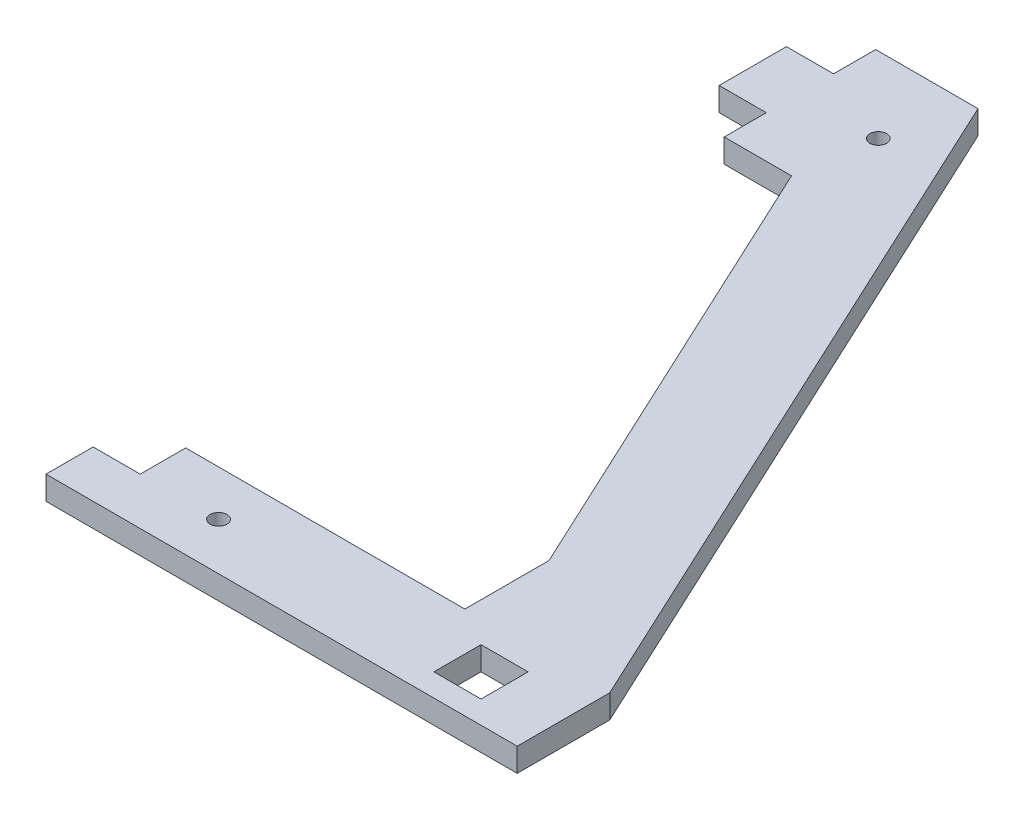
ISO-10303-21;
HEADER;
FILE_DESCRIPTION(('STEP AP214'),'2;1');
FILE_NAME('part.step','',(''),(''),'','','');
FILE_SCHEMA(('AUTOMOTIVE_DESIGN { 1 0 10303 214 1 1 1 1 }'));
ENDSEC;
DATA;
#1=APPLICATION_CONTEXT('core data for automotive mechanical design processes');
#2=APPLICATION_PROTOCOL_DEFINITION('international standard','automotive_design',2000,#1);
#3=PRODUCT_CONTEXT('',#1,'mechanical');
#4=PRODUCT('Part','Part','',(#3));
#5=PRODUCT_RELATED_PRODUCT_CATEGORY('part','',(#4));
#6=PRODUCT_DEFINITION_FORMATION('','',#4);
#7=PRODUCT_DEFINITION_CONTEXT('part definition',#1,'design');
#8=PRODUCT_DEFINITION('design','',#6,#7);
#9=PRODUCT_DEFINITION_SHAPE('','',#8);
#10=(LENGTH_UNIT() NAMED_UNIT(*) SI_UNIT(.MILLI.,.METRE.));
#11=(NAMED_UNIT(*) PLANE_ANGLE_UNIT() SI_UNIT($,.RADIAN.));
#12=(NAMED_UNIT(*) SI_UNIT($,.STERADIAN.) SOLID_ANGLE_UNIT());
#13=UNCERTAINTY_MEASURE_WITH_UNIT(LENGTH_MEASURE(1.E-05),#10,'distance_accuracy_value','');
#14=(GEOMETRIC_REPRESENTATION_CONTEXT(3) GLOBAL_UNCERTAINTY_ASSIGNED_CONTEXT((#13)) GLOBAL_UNIT_ASSIGNED_CONTEXT((#10,
#11,#12)) REPRESENTATION_CONTEXT('',''));
#15=CARTESIAN_POINT('',(0.,0.,0.));
#16=DIRECTION('',(0.,0.,1.));
#17=DIRECTION('',(1.,0.,0.));
#18=AXIS2_PLACEMENT_3D('',#15,#16,#17);
#19=CARTESIAN_POINT('',(0.,7.,0.));
#20=DIRECTION('',(0.,1.,0.));
#21=DIRECTION('',(0.,0.,1.));
#22=AXIS2_PLACEMENT_3D('',#19,#20,#21);
#23=PLANE('',#22);
#24=CARTESIAN_POINT('',(-102.73,7.,-14.));
#25=DIRECTION('',(0.,1.,0.));
#26=DIRECTION('',(0.,0.,1.));
#27=AXIS2_PLACEMENT_3D('',#24,#25,#26);
#28=CIRCLE('',#27,2.49999999999999);
#29=CARTESIAN_POINT('',(-102.73,7.,-11.5));
#30=VERTEX_POINT('',#29);
#31=EDGE_CURVE('E205',#30,#30,#28,.T.);
#32=ORIENTED_EDGE('',*,*,#31,.F.);
#33=EDGE_LOOP('',(#32));
#34=FACE_BOUND('',#33,.T.);
#35=DIRECTION('',(-1.,0.,0.));
#36=VECTOR('',#35,1.);
#37=CARTESIAN_POINT('',(-126.,7.,-232.5));
#38=LINE('',#37,#36);
#39=CARTESIAN_POINT('',(-95.5930699217742,7.,-232.5));
#40=VERTEX_POINT('',#39);
#41=CARTESIAN_POINT('',(-126.,7.,-232.5));
#42=VERTEX_POINT('',#41);
#43=EDGE_CURVE('E215',#40,#42,#38,.T.);
#44=ORIENTED_EDGE('',*,*,#43,.T.);
#45=DIRECTION('',(0.,0.,1.));
#46=VECTOR('',#45,1.);
#47=CARTESIAN_POINT('',(-126.,7.,-220.));
#48=LINE('',#47,#46);
#49=CARTESIAN_POINT('',(-126.,7.,-220.));
#50=VERTEX_POINT('',#49);
#51=EDGE_CURVE('E218',#42,#50,#48,.T.);
#52=ORIENTED_EDGE('',*,*,#51,.T.);
#53=DIRECTION('',(-1.,0.,0.));
#54=VECTOR('',#53,1.);
#55=CARTESIAN_POINT('',(-140.,7.,-220.));
#56=LINE('',#55,#54);
#57=CARTESIAN_POINT('',(-140.,7.,-220.));
#58=VERTEX_POINT('',#57);
#59=EDGE_CURVE('E221',#50,#58,#56,.T.);
#60=ORIENTED_EDGE('',*,*,#59,.T.);
#61=DIRECTION('',(0.,0.,1.));
#62=VECTOR('',#61,1.);
#63=CARTESIAN_POINT('',(-140.,7.,-200.));
#64=LINE('',#63,#62);
#65=CARTESIAN_POINT('',(-140.,7.,-200.));
#66=VERTEX_POINT('',#65);
#67=EDGE_CURVE('E223',#58,#66,#64,.T.);
#68=ORIENTED_EDGE('',*,*,#67,.T.);
#69=DIRECTION('',(1.,0.,0.));
#70=VECTOR('',#69,1.);
#71=CARTESIAN_POINT('',(-126.,7.,-200.));
#72=LINE('',#71,#70);
#73=CARTESIAN_POINT('',(-126.,7.,-200.));
#74=VERTEX_POINT('',#73);
#75=EDGE_CURVE('E225',#66,#74,#72,.T.);
#76=ORIENTED_EDGE('',*,*,#75,.T.);
#77=DIRECTION('',(0.,0.,1.));
#78=VECTOR('',#77,1.);
#79=CARTESIAN_POINT('',(-126.,7.,-187.5));
#80=LINE('',#79,#78);
#81=CARTESIAN_POINT('',(-126.,7.,-187.5));
#82=VERTEX_POINT('',#81);
#83=EDGE_CURVE('E227',#74,#82,#80,.T.);
#84=ORIENTED_EDGE('',*,*,#83,.T.);
#85=DIRECTION('',(1.,0.,0.));
#86=VECTOR('',#85,1.);
#87=CARTESIAN_POINT('',(-126.,7.,-187.5));
#88=LINE('',#87,#86);
#89=CARTESIAN_POINT('',(-106.,7.,-187.5));
#90=VERTEX_POINT('',#89);
#91=EDGE_CURVE('E229',#82,#90,#88,.T.);
#92=ORIENTED_EDGE('',*,*,#91,.T.);
#93=DIRECTION('',(0.422618261740697,0.,0.906307787036651));
#94=VECTOR('',#93,1.);
#95=CARTESIAN_POINT('',(-106.,7.,-187.5));
#96=LINE('',#95,#94);
#97=CARTESIAN_POINT('',(-43.0484661490756,7.,-52.5));
#98=VERTEX_POINT('',#97);
#99=EDGE_CURVE('E231',#90,#98,#96,.T.);
#100=ORIENTED_EDGE('',*,*,#99,.T.);
#101=DIRECTION('',(0.,0.,1.));
#102=VECTOR('',#101,1.);
#103=CARTESIAN_POINT('',(-43.0484661490756,7.,-52.5));
#104=LINE('',#103,#102);
#105=CARTESIAN_POINT('',(-43.0484661490756,7.,-27.5));
#106=VERTEX_POINT('',#105);
#107=EDGE_CURVE('E233',#98,#106,#104,.T.);
#108=ORIENTED_EDGE('',*,*,#107,.T.);
#109=DIRECTION('',(-1.,0.,0.));
#110=VECTOR('',#109,1.);
#111=CARTESIAN_POINT('',(-126.,7.,-27.5));
#112=LINE('',#111,#110);
#113=CARTESIAN_POINT('',(-126.,7.,-27.5));
#114=VERTEX_POINT('',#113);
#115=EDGE_CURVE('E235',#106,#114,#112,.T.);
#116=ORIENTED_EDGE('',*,*,#115,.T.);
#117=DIRECTION('',(0.,0.,1.));
#118=VECTOR('',#117,1.);
#119=CARTESIAN_POINT('',(-126.,7.,-14.));
#120=LINE('',#119,#118);
#121=CARTESIAN_POINT('',(-126.,7.,-14.));
#122=VERTEX_POINT('',#121);
#123=EDGE_CURVE('E237',#114,#122,#120,.T.);
#124=ORIENTED_EDGE('',*,*,#123,.T.);
#125=DIRECTION('',(-1.,0.,0.));
#126=VECTOR('',#125,1.);
#127=CARTESIAN_POINT('',(-140.,7.,-14.));
#128=LINE('',#127,#126);
#129=CARTESIAN_POINT('',(-140.,7.,-14.));
#130=VERTEX_POINT('',#129);
#131=EDGE_CURVE('E239',#122,#130,#128,.T.);
#132=ORIENTED_EDGE('',*,*,#131,.T.);
#133=DIRECTION('',(0.,0.,1.));
#134=VECTOR('',#133,1.);
#135=CARTESIAN_POINT('',(-140.,7.,0.));
#136=LINE('',#135,#134);
#137=CARTESIAN_POINT('',(-140.,7.,0.));
#138=VERTEX_POINT('',#137);
#139=EDGE_CURVE('E241',#130,#138,#136,.T.);
#140=ORIENTED_EDGE('',*,*,#139,.T.);
#141=DIRECTION('',(1.,0.,0.));
#142=VECTOR('',#141,1.);
#143=CARTESIAN_POINT('',(-140.,7.,0.));
#144=LINE('',#143,#142);
#145=CARTESIAN_POINT('',(0.,7.,0.));
#146=VERTEX_POINT('',#145);
#147=EDGE_CURVE('E243',#138,#146,#144,.T.);
#148=ORIENTED_EDGE('',*,*,#147,.T.);
#149=DIRECTION('',(0.,0.,-1.));
#150=VECTOR('',#149,1.);
#151=CARTESIAN_POINT('',(0.,7.,0.));
#152=LINE('',#151,#150);
#153=CARTESIAN_POINT('',(0.,7.,-27.5));
#154=VERTEX_POINT('',#153);
#155=EDGE_CURVE('E245',#146,#154,#152,.T.);
#156=ORIENTED_EDGE('',*,*,#155,.T.);
#157=DIRECTION('',(-0.422618261740697,0.,-0.906307787036651));
#158=VECTOR('',#157,1.);
#159=CARTESIAN_POINT('',(-95.5930699217742,7.,-232.5));
#160=LINE('',#159,#158);
#161=EDGE_CURVE('E247',#154,#40,#160,.T.);
#162=ORIENTED_EDGE('',*,*,#161,.T.);
#163=EDGE_LOOP('',(#44,#52,#60,#68,#76,#84,#92,#100,#108,#116,#124,#132,#140,#148,#156,#162));
#164=FACE_BOUND('',#163,.T.);
#165=DIRECTION('',(-1.,0.,0.));
#166=VECTOR('',#165,1.);
#167=CARTESIAN_POINT('',(-31.5,7.,-20.75));
#168=LINE('',#167,#166);
#169=CARTESIAN_POINT('',(-17.5,7.,-20.75));
#170=VERTEX_POINT('',#169);
#171=CARTESIAN_POINT('',(-31.5,7.,-20.75));
#172=VERTEX_POINT('',#171);
#173=EDGE_CURVE('E184',#170,#172,#168,.T.);
#174=ORIENTED_EDGE('',*,*,#173,.F.);
#175=DIRECTION('',(0.,0.,-1.));
#176=VECTOR('',#175,1.);
#177=CARTESIAN_POINT('',(-17.5,7.,-20.75));
#178=LINE('',#177,#176);
#179=CARTESIAN_POINT('',(-17.5,7.,-6.75));
#180=VERTEX_POINT('',#179);
#181=EDGE_CURVE('E176',#180,#170,#178,.T.);
#182=ORIENTED_EDGE('',*,*,#181,.F.);
#183=DIRECTION('',(1.,0.,0.));
#184=VECTOR('',#183,1.);
#185=CARTESIAN_POINT('',(-31.5,7.,-6.75));
#186=LINE('',#185,#184);
#187=CARTESIAN_POINT('',(-31.5,7.,-6.75));
#188=VERTEX_POINT('',#187);
#189=EDGE_CURVE('E199',#188,#180,#186,.T.);
#190=ORIENTED_EDGE('',*,*,#189,.F.);
#191=DIRECTION('',(0.,0.,1.));
#192=VECTOR('',#191,1.);
#193=CARTESIAN_POINT('',(-31.5,7.,-20.75));
#194=LINE('',#193,#192);
#195=EDGE_CURVE('E197',#172,#188,#194,.T.);
#196=ORIENTED_EDGE('',*,*,#195,.F.);
#197=EDGE_LOOP('',(#174,#182,#190,#196));
#198=FACE_BOUND('',#197,.T.);
#199=CARTESIAN_POINT('',(-102.73,7.,-210.));
#200=DIRECTION('',(0.,1.,0.));
#201=DIRECTION('',(0.,0.,1.));
#202=AXIS2_PLACEMENT_3D('',#199,#200,#201);
#203=CIRCLE('',#202,2.50000000000001);
#204=CARTESIAN_POINT('',(-102.73,7.,-207.5));
#205=VERTEX_POINT('',#204);
#206=EDGE_CURVE('E521',#205,#205,#203,.T.);
#207=ORIENTED_EDGE('',*,*,#206,.F.);
#208=EDGE_LOOP('',(#207));
#209=FACE_BOUND('',#208,.T.);
#210=ADVANCED_FACE('F39',(#34,#164,#198,#209),#23,.T.);
#211=CARTESIAN_POINT('',(0.,0.,0.));
#212=DIRECTION('',(0.,1.,0.));
#213=DIRECTION('',(0.,0.,1.));
#214=AXIS2_PLACEMENT_3D('',#211,#212,#213);
#215=PLANE('',#214);
#216=DIRECTION('',(-1.,0.,0.));
#217=VECTOR('',#216,1.);
#218=CARTESIAN_POINT('',(-126.,0.,-232.5));
#219=LINE('',#218,#217);
#220=CARTESIAN_POINT('',(-95.5930699217742,0.,-232.5));
#221=VERTEX_POINT('',#220);
#222=CARTESIAN_POINT('',(-126.,0.,-232.5));
#223=VERTEX_POINT('',#222);
#224=EDGE_CURVE('E192',#221,#223,#219,.T.);
#225=ORIENTED_EDGE('',*,*,#224,.F.);
#226=DIRECTION('',(-0.422618261740697,0.,-0.906307787036651));
#227=VECTOR('',#226,1.);
#228=CARTESIAN_POINT('',(-95.5930699217742,0.,-232.5));
#229=LINE('',#228,#227);
#230=CARTESIAN_POINT('',(0.,0.,-27.5));
#231=VERTEX_POINT('',#230);
#232=EDGE_CURVE('E219',#231,#221,#229,.T.);
#233=ORIENTED_EDGE('',*,*,#232,.F.);
#234=DIRECTION('',(0.,0.,-1.));
#235=VECTOR('',#234,1.);
#236=CARTESIAN_POINT('',(0.,0.,0.));
#237=LINE('',#236,#235);
#238=CARTESIAN_POINT('',(0.,0.,0.));
#239=VERTEX_POINT('',#238);
#240=EDGE_CURVE('E278',#239,#231,#237,.T.);
#241=ORIENTED_EDGE('',*,*,#240,.F.);
#242=DIRECTION('',(1.,0.,0.));
#243=VECTOR('',#242,1.);
#244=CARTESIAN_POINT('',(-140.,0.,0.));
#245=LINE('',#244,#243);
#246=CARTESIAN_POINT('',(-140.,0.,0.));
#247=VERTEX_POINT('',#246);
#248=EDGE_CURVE('E276',#247,#239,#245,.T.);
#249=ORIENTED_EDGE('',*,*,#248,.F.);
#250=DIRECTION('',(0.,0.,1.));
#251=VECTOR('',#250,1.);
#252=CARTESIAN_POINT('',(-140.,0.,0.));
#253=LINE('',#252,#251);
#254=CARTESIAN_POINT('',(-140.,0.,-14.));
#255=VERTEX_POINT('',#254);
#256=EDGE_CURVE('E274',#255,#247,#253,.T.);
#257=ORIENTED_EDGE('',*,*,#256,.F.);
#258=DIRECTION('',(-1.,0.,0.));
#259=VECTOR('',#258,1.);
#260=CARTESIAN_POINT('',(-140.,0.,-14.));
#261=LINE('',#260,#259);
#262=CARTESIAN_POINT('',(-126.,0.,-14.));
#263=VERTEX_POINT('',#262);
#264=EDGE_CURVE('E272',#263,#255,#261,.T.);
#265=ORIENTED_EDGE('',*,*,#264,.F.);
#266=DIRECTION('',(0.,0.,1.));
#267=VECTOR('',#266,1.);
#268=CARTESIAN_POINT('',(-126.,0.,-14.));
#269=LINE('',#268,#267);
#270=CARTESIAN_POINT('',(-126.,0.,-27.5));
#271=VERTEX_POINT('',#270);
#272=EDGE_CURVE('E270',#271,#263,#269,.T.);
#273=ORIENTED_EDGE('',*,*,#272,.F.);
#274=DIRECTION('',(-1.,0.,0.));
#275=VECTOR('',#274,1.);
#276=CARTESIAN_POINT('',(-126.,0.,-27.5));
#277=LINE('',#276,#275);
#278=CARTESIAN_POINT('',(-43.0484661490756,0.,-27.5));
#279=VERTEX_POINT('',#278);
#280=EDGE_CURVE('E268',#279,#271,#277,.T.);
#281=ORIENTED_EDGE('',*,*,#280,.F.);
#282=DIRECTION('',(0.,0.,1.));
#283=VECTOR('',#282,1.);
#284=CARTESIAN_POINT('',(-43.0484661490756,0.,-52.5));
#285=LINE('',#284,#283);
#286=CARTESIAN_POINT('',(-43.0484661490756,0.,-52.5));
#287=VERTEX_POINT('',#286);
#288=EDGE_CURVE('E266',#287,#279,#285,.T.);
#289=ORIENTED_EDGE('',*,*,#288,.F.);
#290=DIRECTION('',(0.422618261740697,0.,0.906307787036651));
#291=VECTOR('',#290,1.);
#292=CARTESIAN_POINT('',(-106.,0.,-187.5));
#293=LINE('',#292,#291);
#294=CARTESIAN_POINT('',(-106.,0.,-187.5));
#295=VERTEX_POINT('',#294);
#296=EDGE_CURVE('E264',#295,#287,#293,.T.);
#297=ORIENTED_EDGE('',*,*,#296,.F.);
#298=DIRECTION('',(1.,0.,0.));
#299=VECTOR('',#298,1.);
#300=CARTESIAN_POINT('',(-126.,0.,-187.5));
#301=LINE('',#300,#299);
#302=CARTESIAN_POINT('',(-126.,0.,-187.5));
#303=VERTEX_POINT('',#302);
#304=EDGE_CURVE('E262',#303,#295,#301,.T.);
#305=ORIENTED_EDGE('',*,*,#304,.F.);
#306=DIRECTION('',(0.,0.,1.));
#307=VECTOR('',#306,1.);
#308=CARTESIAN_POINT('',(-126.,0.,-187.5));
#309=LINE('',#308,#307);
#310=CARTESIAN_POINT('',(-126.,0.,-200.));
#311=VERTEX_POINT('',#310);
#312=EDGE_CURVE('E260',#311,#303,#309,.T.);
#313=ORIENTED_EDGE('',*,*,#312,.F.);
#314=DIRECTION('',(1.,0.,0.));
#315=VECTOR('',#314,1.);
#316=CARTESIAN_POINT('',(-126.,0.,-200.));
#317=LINE('',#316,#315);
#318=CARTESIAN_POINT('',(-140.,0.,-200.));
#319=VERTEX_POINT('',#318);
#320=EDGE_CURVE('E258',#319,#311,#317,.T.);
#321=ORIENTED_EDGE('',*,*,#320,.F.);
#322=DIRECTION('',(0.,0.,1.));
#323=VECTOR('',#322,1.);
#324=CARTESIAN_POINT('',(-140.,0.,-200.));
#325=LINE('',#324,#323);
#326=CARTESIAN_POINT('',(-140.,0.,-220.));
#327=VERTEX_POINT('',#326);
#328=EDGE_CURVE('E256',#327,#319,#325,.T.);
#329=ORIENTED_EDGE('',*,*,#328,.F.);
#330=DIRECTION('',(-1.,0.,0.));
#331=VECTOR('',#330,1.);
#332=CARTESIAN_POINT('',(-140.,0.,-220.));
#333=LINE('',#332,#331);
#334=CARTESIAN_POINT('',(-126.,0.,-220.));
#335=VERTEX_POINT('',#334);
#336=EDGE_CURVE('E254',#335,#327,#333,.T.);
#337=ORIENTED_EDGE('',*,*,#336,.F.);
#338=DIRECTION('',(0.,0.,1.));
#339=VECTOR('',#338,1.);
#340=CARTESIAN_POINT('',(-126.,0.,-220.));
#341=LINE('',#340,#339);
#342=EDGE_CURVE('E252',#223,#335,#341,.T.);
#343=ORIENTED_EDGE('',*,*,#342,.F.);
#344=EDGE_LOOP('',(#225,#233,#241,#249,#257,#265,#273,#281,#289,#297,#305,#313,#321,#329,#337,#343));
#345=FACE_BOUND('',#344,.T.);
#346=DIRECTION('',(0.,0.,-1.));
#347=VECTOR('',#346,1.);
#348=CARTESIAN_POINT('',(-17.5,0.,-20.75));
#349=LINE('',#348,#347);
#350=CARTESIAN_POINT('',(-17.5,0.,-6.75));
#351=VERTEX_POINT('',#350);
#352=CARTESIAN_POINT('',(-17.5,0.,-20.75));
#353=VERTEX_POINT('',#352);
#354=EDGE_CURVE('E62',#351,#353,#349,.T.);
#355=ORIENTED_EDGE('',*,*,#354,.T.);
#356=DIRECTION('',(-1.,0.,0.));
#357=VECTOR('',#356,1.);
#358=CARTESIAN_POINT('',(-31.5,0.,-20.75));
#359=LINE('',#358,#357);
#360=CARTESIAN_POINT('',(-31.5,0.,-20.75));
#361=VERTEX_POINT('',#360);
#362=EDGE_CURVE('E191',#353,#361,#359,.T.);
#363=ORIENTED_EDGE('',*,*,#362,.T.);
#364=DIRECTION('',(0.,0.,1.));
#365=VECTOR('',#364,1.);
#366=CARTESIAN_POINT('',(-31.5,0.,-20.75));
#367=LINE('',#366,#365);
#368=CARTESIAN_POINT('',(-31.5,0.,-6.75));
#369=VERTEX_POINT('',#368);
#370=EDGE_CURVE('E207',#361,#369,#367,.T.);
#371=ORIENTED_EDGE('',*,*,#370,.T.);
#372=DIRECTION('',(1.,0.,0.));
#373=VECTOR('',#372,1.);
#374=CARTESIAN_POINT('',(-31.5,0.,-6.75));
#375=LINE('',#374,#373);
#376=EDGE_CURVE('E185',#369,#351,#375,.T.);
#377=ORIENTED_EDGE('',*,*,#376,.T.);
#378=EDGE_LOOP('',(#355,#363,#371,#377));
#379=FACE_BOUND('',#378,.T.);
#380=CARTESIAN_POINT('',(-102.73,0.,-14.));
#381=DIRECTION('',(0.,1.,0.));
#382=DIRECTION('',(0.,0.,1.));
#383=AXIS2_PLACEMENT_3D('',#380,#381,#382);
#384=CIRCLE('',#383,2.49999999999999);
#385=CARTESIAN_POINT('',(-102.73,0.,-11.5));
#386=VERTEX_POINT('',#385);
#387=EDGE_CURVE('E527',#386,#386,#384,.T.);
#388=ORIENTED_EDGE('',*,*,#387,.T.);
#389=EDGE_LOOP('',(#388));
#390=FACE_BOUND('',#389,.T.);
#391=CARTESIAN_POINT('',(-102.73,0.,-210.));
#392=DIRECTION('',(0.,1.,0.));
#393=DIRECTION('',(0.,0.,1.));
#394=AXIS2_PLACEMENT_3D('',#391,#392,#393);
#395=CIRCLE('',#394,2.50000000000001);
#396=CARTESIAN_POINT('',(-102.73,0.,-207.5));
#397=VERTEX_POINT('',#396);
#398=EDGE_CURVE('E524',#397,#397,#395,.T.);
#399=ORIENTED_EDGE('',*,*,#398,.T.);
#400=EDGE_LOOP('',(#399));
#401=FACE_BOUND('',#400,.T.);
#402=ADVANCED_FACE('F332',(#345,#379,#390,#401),#215,.F.);
#403=CARTESIAN_POINT('',(-126.,7.,-232.5));
#404=DIRECTION('',(0.,0.,1.));
#405=DIRECTION('',(1.,0.,0.));
#406=AXIS2_PLACEMENT_3D('',#403,#404,#405);
#407=PLANE('',#406);
#408=ORIENTED_EDGE('',*,*,#224,.T.);
#409=DIRECTION('',(0.,-1.,0.));
#410=VECTOR('',#409,1.);
#411=CARTESIAN_POINT('',(-126.,7.,-232.5));
#412=LINE('',#411,#410);
#413=EDGE_CURVE('E11',#42,#223,#412,.T.);
#414=ORIENTED_EDGE('',*,*,#413,.F.);
#415=ORIENTED_EDGE('',*,*,#43,.F.);
#416=DIRECTION('',(0.,-1.,0.));
#417=VECTOR('',#416,1.);
#418=CARTESIAN_POINT('',(-95.5930699217742,7.,-232.5));
#419=LINE('',#418,#417);
#420=EDGE_CURVE('E249',#40,#221,#419,.T.);
#421=ORIENTED_EDGE('',*,*,#420,.T.);
#422=EDGE_LOOP('',(#408,#414,#415,#421));
#423=FACE_BOUND('',#422,.T.);
#424=ADVANCED_FACE('F41',(#423),#407,.F.);
#425=CARTESIAN_POINT('',(-126.,7.,-220.));
#426=DIRECTION('',(1.,0.,0.));
#427=DIRECTION('',(0.,0.,-1.));
#428=AXIS2_PLACEMENT_3D('',#425,#426,#427);
#429=PLANE('',#428);
#430=ORIENTED_EDGE('',*,*,#342,.T.);
#431=DIRECTION('',(0.,-1.,0.));
#432=VECTOR('',#431,1.);
#433=CARTESIAN_POINT('',(-126.,7.,-220.));
#434=LINE('',#433,#432);
#435=EDGE_CURVE('E47',#50,#335,#434,.T.);
#436=ORIENTED_EDGE('',*,*,#435,.F.);
#437=ORIENTED_EDGE('',*,*,#51,.F.);
#438=ORIENTED_EDGE('',*,*,#413,.T.);
#439=EDGE_LOOP('',(#430,#436,#437,#438));
#440=FACE_BOUND('',#439,.T.);
#441=ADVANCED_FACE('F349',(#440),#429,.F.);
#442=CARTESIAN_POINT('',(-140.,7.,-220.));
#443=DIRECTION('',(0.,0.,1.));
#444=DIRECTION('',(1.,0.,0.));
#445=AXIS2_PLACEMENT_3D('',#442,#443,#444);
#446=PLANE('',#445);
#447=ORIENTED_EDGE('',*,*,#336,.T.);
#448=DIRECTION('',(0.,-1.,0.));
#449=VECTOR('',#448,1.);
#450=CARTESIAN_POINT('',(-140.,7.,-220.));
#451=LINE('',#450,#449);
#452=EDGE_CURVE('E319',#58,#327,#451,.T.);
#453=ORIENTED_EDGE('',*,*,#452,.F.);
#454=ORIENTED_EDGE('',*,*,#59,.F.);
#455=ORIENTED_EDGE('',*,*,#435,.T.);
#456=EDGE_LOOP('',(#447,#453,#454,#455));
#457=FACE_BOUND('',#456,.T.);
#458=ADVANCED_FACE('F326',(#457),#446,.F.);
#459=CARTESIAN_POINT('',(-140.,7.,-200.));
#460=DIRECTION('',(1.,0.,0.));
#461=DIRECTION('',(0.,0.,-1.));
#462=AXIS2_PLACEMENT_3D('',#459,#460,#461);
#463=PLANE('',#462);
#464=ORIENTED_EDGE('',*,*,#328,.T.);
#465=DIRECTION('',(0.,-1.,0.));
#466=VECTOR('',#465,1.);
#467=CARTESIAN_POINT('',(-140.,7.,-200.));
#468=LINE('',#467,#466);
#469=EDGE_CURVE('E316',#66,#319,#468,.T.);
#470=ORIENTED_EDGE('',*,*,#469,.F.);
#471=ORIENTED_EDGE('',*,*,#67,.F.);
#472=ORIENTED_EDGE('',*,*,#452,.T.);
#473=EDGE_LOOP('',(#464,#470,#471,#472));
#474=FACE_BOUND('',#473,.T.);
#475=ADVANCED_FACE('F338',(#474),#463,.F.);
#476=CARTESIAN_POINT('',(-126.,7.,-200.));
#477=DIRECTION('',(0.,0.,-1.));
#478=DIRECTION('',(-1.,0.,0.));
#479=AXIS2_PLACEMENT_3D('',#476,#477,#478);
#480=PLANE('',#479);
#481=ORIENTED_EDGE('',*,*,#320,.T.);
#482=DIRECTION('',(0.,-1.,0.));
#483=VECTOR('',#482,1.);
#484=CARTESIAN_POINT('',(-126.,7.,-200.));
#485=LINE('',#484,#483);
#486=EDGE_CURVE('E313',#74,#311,#485,.T.);
#487=ORIENTED_EDGE('',*,*,#486,.F.);
#488=ORIENTED_EDGE('',*,*,#75,.F.);
#489=ORIENTED_EDGE('',*,*,#469,.T.);
#490=EDGE_LOOP('',(#481,#487,#488,#489));
#491=FACE_BOUND('',#490,.T.);
#492=ADVANCED_FACE('F342',(#491),#480,.F.);
#493=CARTESIAN_POINT('',(-126.,7.,-187.5));
#494=DIRECTION('',(1.,0.,0.));
#495=DIRECTION('',(0.,0.,-1.));
#496=AXIS2_PLACEMENT_3D('',#493,#494,#495);
#497=PLANE('',#496);
#498=ORIENTED_EDGE('',*,*,#312,.T.);
#499=DIRECTION('',(0.,-1.,0.));
#500=VECTOR('',#499,1.);
#501=CARTESIAN_POINT('',(-126.,7.,-187.5));
#502=LINE('',#501,#500);
#503=EDGE_CURVE('E310',#82,#303,#502,.T.);
#504=ORIENTED_EDGE('',*,*,#503,.F.);
#505=ORIENTED_EDGE('',*,*,#83,.F.);
#506=ORIENTED_EDGE('',*,*,#486,.T.);
#507=EDGE_LOOP('',(#498,#504,#505,#506));
#508=FACE_BOUND('',#507,.T.);
#509=ADVANCED_FACE('F402',(#508),#497,.F.);
#510=CARTESIAN_POINT('',(-126.,7.,-187.5));
#511=DIRECTION('',(0.,0.,-1.));
#512=DIRECTION('',(-1.,0.,0.));
#513=AXIS2_PLACEMENT_3D('',#510,#511,#512);
#514=PLANE('',#513);
#515=ORIENTED_EDGE('',*,*,#304,.T.);
#516=DIRECTION('',(0.,-1.,0.));
#517=VECTOR('',#516,1.);
#518=CARTESIAN_POINT('',(-106.,7.,-187.5));
#519=LINE('',#518,#517);
#520=EDGE_CURVE('E307',#90,#295,#519,.T.);
#521=ORIENTED_EDGE('',*,*,#520,.F.);
#522=ORIENTED_EDGE('',*,*,#91,.F.);
#523=ORIENTED_EDGE('',*,*,#503,.T.);
#524=EDGE_LOOP('',(#515,#521,#522,#523));
#525=FACE_BOUND('',#524,.T.);
#526=ADVANCED_FACE('F399',(#525),#514,.F.);
#527=CARTESIAN_POINT('',(-106.,7.,-187.5));
#528=DIRECTION('',(0.906307787036651,0.,-0.422618261740697));
#529=DIRECTION('',(-0.422618261740697,0.,-0.906307787036651));
#530=AXIS2_PLACEMENT_3D('',#527,#528,#529);
#531=PLANE('',#530);
#532=ORIENTED_EDGE('',*,*,#296,.T.);
#533=DIRECTION('',(0.,-1.,0.));
#534=VECTOR('',#533,1.);
#535=CARTESIAN_POINT('',(-43.0484661490756,7.,-52.5));
#536=LINE('',#535,#534);
#537=EDGE_CURVE('E304',#98,#287,#536,.T.);
#538=ORIENTED_EDGE('',*,*,#537,.F.);
#539=ORIENTED_EDGE('',*,*,#99,.F.);
#540=ORIENTED_EDGE('',*,*,#520,.T.);
#541=EDGE_LOOP('',(#532,#538,#539,#540));
#542=FACE_BOUND('',#541,.T.);
#543=ADVANCED_FACE('F395',(#542),#531,.F.);
#544=CARTESIAN_POINT('',(-43.0484661490756,7.,-52.5));
#545=DIRECTION('',(1.,0.,0.));
#546=DIRECTION('',(0.,0.,-1.));
#547=AXIS2_PLACEMENT_3D('',#544,#545,#546);
#548=PLANE('',#547);
#549=ORIENTED_EDGE('',*,*,#288,.T.);
#550=DIRECTION('',(0.,-1.,0.));
#551=VECTOR('',#550,1.);
#552=CARTESIAN_POINT('',(-43.0484661490756,7.,-27.5));
#553=LINE('',#552,#551);
#554=EDGE_CURVE('E301',#106,#279,#553,.T.);
#555=ORIENTED_EDGE('',*,*,#554,.F.);
#556=ORIENTED_EDGE('',*,*,#107,.F.);
#557=ORIENTED_EDGE('',*,*,#537,.T.);
#558=EDGE_LOOP('',(#549,#555,#556,#557));
#559=FACE_BOUND('',#558,.T.);
#560=ADVANCED_FACE('F391',(#559),#548,.F.);
#561=CARTESIAN_POINT('',(-126.,7.,-27.5));
#562=DIRECTION('',(0.,0.,1.));
#563=DIRECTION('',(1.,0.,0.));
#564=AXIS2_PLACEMENT_3D('',#561,#562,#563);
#565=PLANE('',#564);
#566=ORIENTED_EDGE('',*,*,#280,.T.);
#567=DIRECTION('',(0.,-1.,0.));
#568=VECTOR('',#567,1.);
#569=CARTESIAN_POINT('',(-126.,7.,-27.5));
#570=LINE('',#569,#568);
#571=EDGE_CURVE('E298',#114,#271,#570,.T.);
#572=ORIENTED_EDGE('',*,*,#571,.F.);
#573=ORIENTED_EDGE('',*,*,#115,.F.);
#574=ORIENTED_EDGE('',*,*,#554,.T.);
#575=EDGE_LOOP('',(#566,#572,#573,#574));
#576=FACE_BOUND('',#575,.T.);
#577=ADVANCED_FACE('F386',(#576),#565,.F.);
#578=CARTESIAN_POINT('',(-126.,7.,-14.));
#579=DIRECTION('',(1.,0.,0.));
#580=DIRECTION('',(0.,0.,-1.));
#581=AXIS2_PLACEMENT_3D('',#578,#579,#580);
#582=PLANE('',#581);
#583=ORIENTED_EDGE('',*,*,#272,.T.);
#584=DIRECTION('',(0.,-1.,0.));
#585=VECTOR('',#584,1.);
#586=CARTESIAN_POINT('',(-126.,7.,-14.));
#587=LINE('',#586,#585);
#588=EDGE_CURVE('E295',#122,#263,#587,.T.);
#589=ORIENTED_EDGE('',*,*,#588,.F.);
#590=ORIENTED_EDGE('',*,*,#123,.F.);
#591=ORIENTED_EDGE('',*,*,#571,.T.);
#592=EDGE_LOOP('',(#583,#589,#590,#591));
#593=FACE_BOUND('',#592,.T.);
#594=ADVANCED_FACE('F380',(#593),#582,.F.);
#595=CARTESIAN_POINT('',(-140.,7.,-14.));
#596=DIRECTION('',(0.,0.,1.));
#597=DIRECTION('',(1.,0.,0.));
#598=AXIS2_PLACEMENT_3D('',#595,#596,#597);
#599=PLANE('',#598);
#600=ORIENTED_EDGE('',*,*,#264,.T.);
#601=DIRECTION('',(0.,-1.,0.));
#602=VECTOR('',#601,1.);
#603=CARTESIAN_POINT('',(-140.,7.,-14.));
#604=LINE('',#603,#602);
#605=EDGE_CURVE('E292',#130,#255,#604,.T.);
#606=ORIENTED_EDGE('',*,*,#605,.F.);
#607=ORIENTED_EDGE('',*,*,#131,.F.);
#608=ORIENTED_EDGE('',*,*,#588,.T.);
#609=EDGE_LOOP('',(#600,#606,#607,#608));
#610=FACE_BOUND('',#609,.T.);
#611=ADVANCED_FACE('F376',(#610),#599,.F.);
#612=CARTESIAN_POINT('',(-140.,7.,0.));
#613=DIRECTION('',(1.,0.,0.));
#614=DIRECTION('',(0.,0.,-1.));
#615=AXIS2_PLACEMENT_3D('',#612,#613,#614);
#616=PLANE('',#615);
#617=ORIENTED_EDGE('',*,*,#256,.T.);
#618=DIRECTION('',(0.,-1.,0.));
#619=VECTOR('',#618,1.);
#620=CARTESIAN_POINT('',(-140.,7.,0.));
#621=LINE('',#620,#619);
#622=EDGE_CURVE('E289',#138,#247,#621,.T.);
#623=ORIENTED_EDGE('',*,*,#622,.F.);
#624=ORIENTED_EDGE('',*,*,#139,.F.);
#625=ORIENTED_EDGE('',*,*,#605,.T.);
#626=EDGE_LOOP('',(#617,#623,#624,#625));
#627=FACE_BOUND('',#626,.T.);
#628=ADVANCED_FACE('F371',(#627),#616,.F.);
#629=CARTESIAN_POINT('',(-140.,7.,0.));
#630=DIRECTION('',(0.,0.,-1.));
#631=DIRECTION('',(-1.,0.,0.));
#632=AXIS2_PLACEMENT_3D('',#629,#630,#631);
#633=PLANE('',#632);
#634=ORIENTED_EDGE('',*,*,#248,.T.);
#635=DIRECTION('',(0.,-1.,0.));
#636=VECTOR('',#635,1.);
#637=CARTESIAN_POINT('',(0.,7.,0.));
#638=LINE('',#637,#636);
#639=EDGE_CURVE('E286',#146,#239,#638,.T.);
#640=ORIENTED_EDGE('',*,*,#639,.F.);
#641=ORIENTED_EDGE('',*,*,#147,.F.);
#642=ORIENTED_EDGE('',*,*,#622,.T.);
#643=EDGE_LOOP('',(#634,#640,#641,#642));
#644=FACE_BOUND('',#643,.T.);
#645=ADVANCED_FACE('F365',(#644),#633,.F.);
#646=CARTESIAN_POINT('',(0.,7.,0.));
#647=DIRECTION('',(-1.,0.,0.));
#648=DIRECTION('',(0.,0.,1.));
#649=AXIS2_PLACEMENT_3D('',#646,#647,#648);
#650=PLANE('',#649);
#651=ORIENTED_EDGE('',*,*,#240,.T.);
#652=DIRECTION('',(0.,-1.,0.));
#653=VECTOR('',#652,1.);
#654=CARTESIAN_POINT('',(0.,7.,-27.5));
#655=LINE('',#654,#653);
#656=EDGE_CURVE('E283',#154,#231,#655,.T.);
#657=ORIENTED_EDGE('',*,*,#656,.F.);
#658=ORIENTED_EDGE('',*,*,#155,.F.);
#659=ORIENTED_EDGE('',*,*,#639,.T.);
#660=EDGE_LOOP('',(#651,#657,#658,#659));
#661=FACE_BOUND('',#660,.T.);
#662=ADVANCED_FACE('F361',(#661),#650,.F.);
#663=CARTESIAN_POINT('',(-95.5930699217742,7.,-232.5));
#664=DIRECTION('',(-0.906307787036651,0.,0.422618261740697));
#665=DIRECTION('',(0.422618261740698,0.,0.906307787036651));
#666=AXIS2_PLACEMENT_3D('',#663,#664,#665);
#667=PLANE('',#666);
#668=ORIENTED_EDGE('',*,*,#232,.T.);
#669=ORIENTED_EDGE('',*,*,#420,.F.);
#670=ORIENTED_EDGE('',*,*,#161,.F.);
#671=ORIENTED_EDGE('',*,*,#656,.T.);
#672=EDGE_LOOP('',(#668,#669,#670,#671));
#673=FACE_BOUND('',#672,.T.);
#674=ADVANCED_FACE('F356',(#673),#667,.F.);
#675=CARTESIAN_POINT('',(-17.5,7.,-20.75));
#676=DIRECTION('',(-1.,0.,0.));
#677=DIRECTION('',(0.,0.,1.));
#678=AXIS2_PLACEMENT_3D('',#675,#676,#677);
#679=PLANE('',#678);
#680=ORIENTED_EDGE('',*,*,#354,.F.);
#681=DIRECTION('',(0.,-1.,0.));
#682=VECTOR('',#681,1.);
#683=CARTESIAN_POINT('',(-17.5,7.,-6.75));
#684=LINE('',#683,#682);
#685=EDGE_CURVE('E180',#180,#351,#684,.T.);
#686=ORIENTED_EDGE('',*,*,#685,.F.);
#687=ORIENTED_EDGE('',*,*,#181,.T.);
#688=DIRECTION('',(0.,-1.,0.));
#689=VECTOR('',#688,1.);
#690=CARTESIAN_POINT('',(-17.5,7.,-20.75));
#691=LINE('',#690,#689);
#692=EDGE_CURVE('E179',#170,#353,#691,.T.);
#693=ORIENTED_EDGE('',*,*,#692,.T.);
#694=EDGE_LOOP('',(#680,#686,#687,#693));
#695=FACE_BOUND('',#694,.T.);
#696=ADVANCED_FACE('F178',(#695),#679,.T.);
#697=CARTESIAN_POINT('',(-31.5,7.,-20.75));
#698=DIRECTION('',(0.,0.,1.));
#699=DIRECTION('',(1.,0.,0.));
#700=AXIS2_PLACEMENT_3D('',#697,#698,#699);
#701=PLANE('',#700);
#702=ORIENTED_EDGE('',*,*,#362,.F.);
#703=ORIENTED_EDGE('',*,*,#692,.F.);
#704=ORIENTED_EDGE('',*,*,#173,.T.);
#705=DIRECTION('',(0.,-1.,0.));
#706=VECTOR('',#705,1.);
#707=CARTESIAN_POINT('',(-31.5,7.,-20.75));
#708=LINE('',#707,#706);
#709=EDGE_CURVE('E193',#172,#361,#708,.T.);
#710=ORIENTED_EDGE('',*,*,#709,.T.);
#711=EDGE_LOOP('',(#702,#703,#704,#710));
#712=FACE_BOUND('',#711,.T.);
#713=ADVANCED_FACE('F188',(#712),#701,.T.);
#714=CARTESIAN_POINT('',(-31.5,7.,-20.75));
#715=DIRECTION('',(1.,0.,0.));
#716=DIRECTION('',(0.,0.,-1.));
#717=AXIS2_PLACEMENT_3D('',#714,#715,#716);
#718=PLANE('',#717);
#719=ORIENTED_EDGE('',*,*,#370,.F.);
#720=ORIENTED_EDGE('',*,*,#709,.F.);
#721=ORIENTED_EDGE('',*,*,#195,.T.);
#722=DIRECTION('',(0.,-1.,0.));
#723=VECTOR('',#722,1.);
#724=CARTESIAN_POINT('',(-31.5,7.,-6.75));
#725=LINE('',#724,#723);
#726=EDGE_CURVE('E54',#188,#369,#725,.T.);
#727=ORIENTED_EDGE('',*,*,#726,.T.);
#728=EDGE_LOOP('',(#719,#720,#721,#727));
#729=FACE_BOUND('',#728,.T.);
#730=ADVANCED_FACE('F486',(#729),#718,.T.);
#731=CARTESIAN_POINT('',(-31.5,7.,-6.75));
#732=DIRECTION('',(0.,0.,-1.));
#733=DIRECTION('',(-1.,0.,0.));
#734=AXIS2_PLACEMENT_3D('',#731,#732,#733);
#735=PLANE('',#734);
#736=ORIENTED_EDGE('',*,*,#376,.F.);
#737=ORIENTED_EDGE('',*,*,#726,.F.);
#738=ORIENTED_EDGE('',*,*,#189,.T.);
#739=ORIENTED_EDGE('',*,*,#685,.T.);
#740=EDGE_LOOP('',(#736,#737,#738,#739));
#741=FACE_BOUND('',#740,.T.);
#742=ADVANCED_FACE('F492',(#741),#735,.T.);
#743=CARTESIAN_POINT('',(-102.73,7.,-14.));
#744=DIRECTION('',(0.,-1.,0.));
#745=DIRECTION('',(0.,0.,-1.));
#746=AXIS2_PLACEMENT_3D('',#743,#744,#745);
#747=CYLINDRICAL_SURFACE('',#746,2.49999999999999);
#748=ORIENTED_EDGE('',*,*,#31,.T.);
#749=EDGE_LOOP('',(#748));
#750=FACE_BOUND('',#749,.T.);
#751=ORIENTED_EDGE('',*,*,#387,.F.);
#752=EDGE_LOOP('',(#751));
#753=FACE_BOUND('',#752,.T.);
#754=ADVANCED_FACE('F500',(#750,#753),#747,.F.);
#755=CARTESIAN_POINT('',(-102.73,7.,-210.));
#756=DIRECTION('',(0.,-1.,0.));
#757=DIRECTION('',(0.,0.,-1.));
#758=AXIS2_PLACEMENT_3D('',#755,#756,#757);
#759=CYLINDRICAL_SURFACE('',#758,2.50000000000001);
#760=ORIENTED_EDGE('',*,*,#206,.T.);
#761=EDGE_LOOP('',(#760));
#762=FACE_BOUND('',#761,.T.);
#763=ORIENTED_EDGE('',*,*,#398,.F.);
#764=EDGE_LOOP('',(#763));
#765=FACE_BOUND('',#764,.T.);
#766=ADVANCED_FACE('F507',(#762,#765),#759,.F.);
#767=CLOSED_SHELL('',(#210,#402,#424,#441,#458,#475,#492,#509,#526,#543,#560,#577,#594,#611,
#628,#645,#662,#674,#696,#713,#730,#742,#754,#766));
#768=MANIFOLD_SOLID_BREP('B2',#767);
#769=ADVANCED_BREP_SHAPE_REPRESENTATION('',(#18,#768),#14);
#770=SHAPE_DEFINITION_REPRESENTATION(#9,#769);
ENDSEC;
END-ISO-10303-21;
